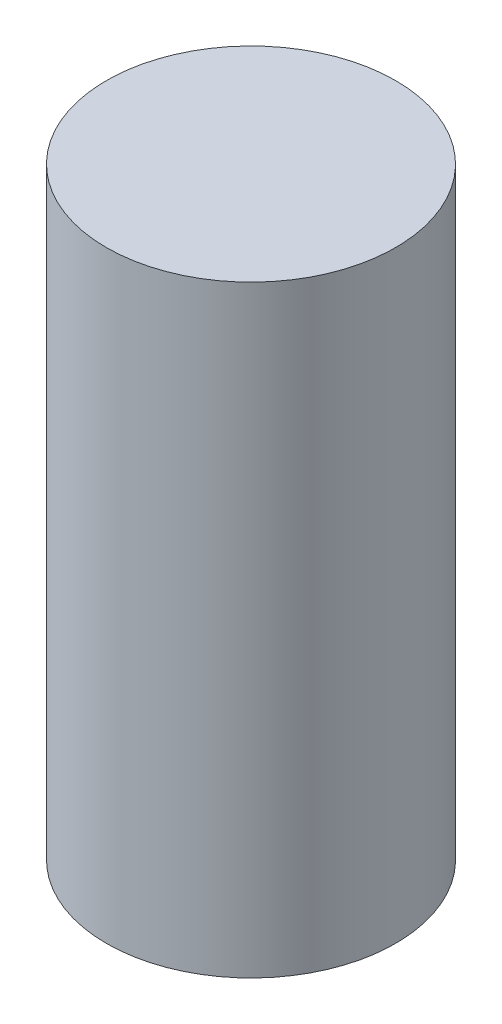
ISO-10303-21;
HEADER;
FILE_DESCRIPTION(('STEP AP214'),'2;1');
FILE_NAME('part.step','',(''),(''),'','','');
FILE_SCHEMA(('AUTOMOTIVE_DESIGN { 1 0 10303 214 1 1 1 1 }'));
ENDSEC;
DATA;
#1=APPLICATION_CONTEXT('core data for automotive mechanical design processes');
#2=APPLICATION_PROTOCOL_DEFINITION('international standard','automotive_design',2000,#1);
#3=PRODUCT_CONTEXT('',#1,'mechanical');
#4=PRODUCT('Part','Part','',(#3));
#5=PRODUCT_RELATED_PRODUCT_CATEGORY('part','',(#4));
#6=PRODUCT_DEFINITION_FORMATION('','',#4);
#7=PRODUCT_DEFINITION_CONTEXT('part definition',#1,'design');
#8=PRODUCT_DEFINITION('design','',#6,#7);
#9=PRODUCT_DEFINITION_SHAPE('','',#8);
#10=(LENGTH_UNIT() NAMED_UNIT(*) SI_UNIT(.MILLI.,.METRE.));
#11=(NAMED_UNIT(*) PLANE_ANGLE_UNIT() SI_UNIT($,.RADIAN.));
#12=(NAMED_UNIT(*) SI_UNIT($,.STERADIAN.) SOLID_ANGLE_UNIT());
#13=UNCERTAINTY_MEASURE_WITH_UNIT(LENGTH_MEASURE(1.E-05),#10,'distance_accuracy_value','');
#14=(GEOMETRIC_REPRESENTATION_CONTEXT(3) GLOBAL_UNCERTAINTY_ASSIGNED_CONTEXT((#13)) GLOBAL_UNIT_ASSIGNED_CONTEXT((#10,
#11,#12)) REPRESENTATION_CONTEXT('',''));
#15=CARTESIAN_POINT('',(0.,0.,0.));
#16=DIRECTION('',(0.,0.,1.));
#17=DIRECTION('',(1.,0.,0.));
#18=AXIS2_PLACEMENT_3D('',#15,#16,#17);
#19=CARTESIAN_POINT('',(0.,1.5875,0.));
#20=DIRECTION('',(0.,-1.,0.));
#21=DIRECTION('',(0.,0.,-1.));
#22=AXIS2_PLACEMENT_3D('',#19,#20,#21);
#23=CYLINDRICAL_SURFACE('',#22,0.762000000000001);
#24=CARTESIAN_POINT('',(0.,1.5875,0.));
#25=DIRECTION('',(0.,1.,0.));
#26=DIRECTION('',(0.,0.,1.));
#27=AXIS2_PLACEMENT_3D('',#24,#25,#26);
#28=CIRCLE('',#27,0.762000000000001);
#29=CARTESIAN_POINT('',(0.,1.5875,0.762000000000001));
#30=VERTEX_POINT('',#29);
#31=EDGE_CURVE('E10',#30,#30,#28,.T.);
#32=ORIENTED_EDGE('',*,*,#31,.F.);
#33=EDGE_LOOP('',(#32));
#34=FACE_BOUND('',#33,.T.);
#35=CARTESIAN_POINT('',(0.,-1.5875,0.));
#36=DIRECTION('',(0.,1.,0.));
#37=DIRECTION('',(0.,0.,1.));
#38=AXIS2_PLACEMENT_3D('',#35,#36,#37);
#39=CIRCLE('',#38,0.762000000000001);
#40=CARTESIAN_POINT('',(0.,-1.5875,0.762000000000001));
#41=VERTEX_POINT('',#40);
#42=EDGE_CURVE('E36',#41,#41,#39,.T.);
#43=ORIENTED_EDGE('',*,*,#42,.T.);
#44=EDGE_LOOP('',(#43));
#45=FACE_BOUND('',#44,.T.);
#46=ADVANCED_FACE('F33',(#34,#45),#23,.T.);
#47=CARTESIAN_POINT('',(0.,1.5875,0.));
#48=DIRECTION('',(0.,1.,0.));
#49=DIRECTION('',(0.,0.,1.));
#50=AXIS2_PLACEMENT_3D('',#47,#48,#49);
#51=PLANE('',#50);
#52=ORIENTED_EDGE('',*,*,#31,.T.);
#53=EDGE_LOOP('',(#52));
#54=FACE_BOUND('',#53,.T.);
#55=ADVANCED_FACE('F48',(#54),#51,.T.);
#56=CARTESIAN_POINT('',(0.,-1.5875,0.));
#57=DIRECTION('',(0.,1.,0.));
#58=DIRECTION('',(0.,0.,1.));
#59=AXIS2_PLACEMENT_3D('',#56,#57,#58);
#60=PLANE('',#59);
#61=ORIENTED_EDGE('',*,*,#42,.F.);
#62=EDGE_LOOP('',(#61));
#63=FACE_BOUND('',#62,.T.);
#64=ADVANCED_FACE('F46',(#63),#60,.F.);
#65=CLOSED_SHELL('',(#46,#55,#64));
#66=MANIFOLD_SOLID_BREP('B2',#65);
#67=ADVANCED_BREP_SHAPE_REPRESENTATION('',(#18,#66),#14);
#68=SHAPE_DEFINITION_REPRESENTATION(#9,#67);
ENDSEC;
END-ISO-10303-21;
